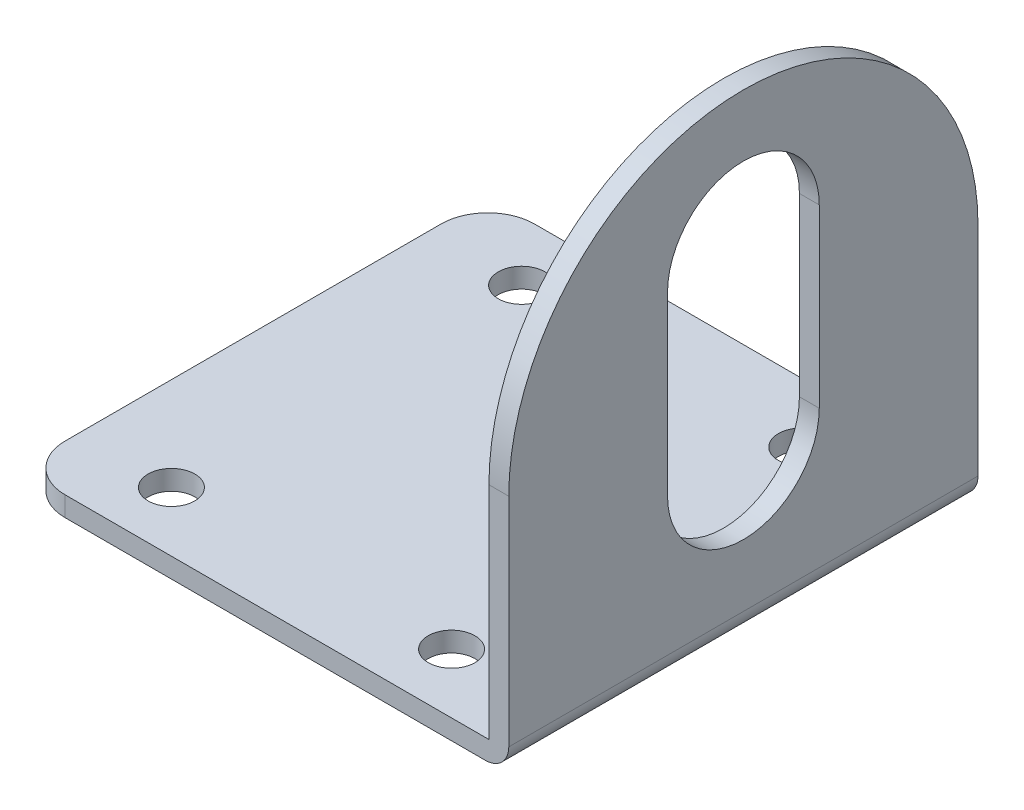
ISO-10303-21;
HEADER;
FILE_DESCRIPTION(('STEP AP214'),'2;1');
FILE_NAME('part.step','',(''),(''),'','','');
FILE_SCHEMA(('AUTOMOTIVE_DESIGN { 1 0 10303 214 1 1 1 1 }'));
ENDSEC;
DATA;
#1=APPLICATION_CONTEXT('core data for automotive mechanical design processes');
#2=APPLICATION_PROTOCOL_DEFINITION('international standard','automotive_design',2000,#1);
#3=PRODUCT_CONTEXT('',#1,'mechanical');
#4=PRODUCT('Part','Part','',(#3));
#5=PRODUCT_RELATED_PRODUCT_CATEGORY('part','',(#4));
#6=PRODUCT_DEFINITION_FORMATION('','',#4);
#7=PRODUCT_DEFINITION_CONTEXT('part definition',#1,'design');
#8=PRODUCT_DEFINITION('design','',#6,#7);
#9=PRODUCT_DEFINITION_SHAPE('','',#8);
#10=(LENGTH_UNIT() NAMED_UNIT(*) SI_UNIT(.MILLI.,.METRE.));
#11=(NAMED_UNIT(*) PLANE_ANGLE_UNIT() SI_UNIT($,.RADIAN.));
#12=(NAMED_UNIT(*) SI_UNIT($,.STERADIAN.) SOLID_ANGLE_UNIT());
#13=UNCERTAINTY_MEASURE_WITH_UNIT(LENGTH_MEASURE(1.E-05),#10,'distance_accuracy_value','');
#14=(GEOMETRIC_REPRESENTATION_CONTEXT(3) GLOBAL_UNCERTAINTY_ASSIGNED_CONTEXT((#13)) GLOBAL_UNIT_ASSIGNED_CONTEXT((#10,
#11,#12)) REPRESENTATION_CONTEXT('',''));
#15=CARTESIAN_POINT('',(0.,0.,0.));
#16=DIRECTION('',(0.,0.,1.));
#17=DIRECTION('',(1.,0.,0.));
#18=AXIS2_PLACEMENT_3D('',#15,#16,#17);
#19=CARTESIAN_POINT('',(-0.299999999999993,0.300000000000009,-40.2));
#20=DIRECTION('',(0.,0.,1.));
#21=DIRECTION('',(-1.,0.,0.));
#22=AXIS2_PLACEMENT_3D('',#19,#20,#21);
#23=CYLINDRICAL_SURFACE('',#22,2.);
#24=DIRECTION('',(0.,0.,1.));
#25=VECTOR('',#24,1.);
#26=CARTESIAN_POINT('',(1.70000000000001,0.300000000000009,-40.2));
#27=LINE('',#26,#25);
#28=CARTESIAN_POINT('',(1.70000000000001,0.300000000000002,-40.2));
#29=VERTEX_POINT('',#28);
#30=CARTESIAN_POINT('',(1.70000000000001,0.300000000000002,0.));
#31=VERTEX_POINT('',#30);
#32=EDGE_CURVE('E232',#29,#31,#27,.T.);
#33=ORIENTED_EDGE('',*,*,#32,.T.);
#34=CARTESIAN_POINT('',(-0.299999999999993,0.300000000000009,0.));
#35=DIRECTION('',(0.,0.,1.));
#36=DIRECTION('',(1.,0.,0.));
#37=AXIS2_PLACEMENT_3D('',#34,#35,#36);
#38=CIRCLE('',#37,2.);
#39=CARTESIAN_POINT('',(-0.299999999999992,-1.69999999999999,0.));
#40=VERTEX_POINT('',#39);
#41=EDGE_CURVE('E11',#31,#40,#38,.F.);
#42=ORIENTED_EDGE('',*,*,#41,.T.);
#43=DIRECTION('',(0.,0.,1.));
#44=VECTOR('',#43,1.);
#45=CARTESIAN_POINT('',(-0.299999999999993,-1.69999999999999,-40.2));
#46=LINE('',#45,#44);
#47=CARTESIAN_POINT('',(-0.299999999999992,-1.69999999999999,-40.2));
#48=VERTEX_POINT('',#47);
#49=EDGE_CURVE('E235',#40,#48,#46,.F.);
#50=ORIENTED_EDGE('',*,*,#49,.T.);
#51=CARTESIAN_POINT('',(-0.299999999999993,0.300000000000009,-40.2));
#52=DIRECTION('',(0.,0.,1.));
#53=DIRECTION('',(1.,0.,0.));
#54=AXIS2_PLACEMENT_3D('',#51,#52,#53);
#55=CIRCLE('',#54,2.);
#56=EDGE_CURVE('E42',#48,#29,#55,.T.);
#57=ORIENTED_EDGE('',*,*,#56,.T.);
#58=EDGE_LOOP('',(#33,#42,#50,#57));
#59=FACE_BOUND('',#58,.T.);
#60=ADVANCED_FACE('F35',(#59),#23,.T.);
#61=CARTESIAN_POINT('',(1.7,18.9,-20.1));
#62=DIRECTION('',(-1.,0.,0.));
#63=DIRECTION('',(0.,0.,-1.));
#64=AXIS2_PLACEMENT_3D('',#61,#62,#63);
#65=CYLINDRICAL_SURFACE('',#64,20.1);
#66=DIRECTION('',(1.,0.,0.));
#67=VECTOR('',#66,1.);
#68=CARTESIAN_POINT('',(1.7,18.9,-40.2));
#69=LINE('',#68,#67);
#70=CARTESIAN_POINT('',(1.7,18.9,-40.2));
#71=VERTEX_POINT('',#70);
#72=CARTESIAN_POINT('',(0.,18.9,-40.2));
#73=VERTEX_POINT('',#72);
#74=EDGE_CURVE('E211',#71,#73,#69,.F.);
#75=ORIENTED_EDGE('',*,*,#74,.T.);
#76=CARTESIAN_POINT('',(0.,18.9,-20.1));
#77=DIRECTION('',(-1.,0.,0.));
#78=DIRECTION('',(0.,1.,0.));
#79=AXIS2_PLACEMENT_3D('',#76,#77,#78);
#80=CIRCLE('',#79,20.1);
#81=CARTESIAN_POINT('',(0.,18.9,0.));
#82=VERTEX_POINT('',#81);
#83=EDGE_CURVE('E220',#73,#82,#80,.F.);
#84=ORIENTED_EDGE('',*,*,#83,.T.);
#85=DIRECTION('',(-1.,0.,0.));
#86=VECTOR('',#85,1.);
#87=CARTESIAN_POINT('',(0.,18.9,0.));
#88=LINE('',#87,#86);
#89=CARTESIAN_POINT('',(1.7,18.9,0.));
#90=VERTEX_POINT('',#89);
#91=EDGE_CURVE('E214',#82,#90,#88,.F.);
#92=ORIENTED_EDGE('',*,*,#91,.T.);
#93=CARTESIAN_POINT('',(1.7,18.9,-20.1));
#94=DIRECTION('',(1.,0.,0.));
#95=DIRECTION('',(0.,-1.,0.));
#96=AXIS2_PLACEMENT_3D('',#93,#94,#95);
#97=CIRCLE('',#96,20.1);
#98=EDGE_CURVE('E217',#90,#71,#97,.F.);
#99=ORIENTED_EDGE('',*,*,#98,.T.);
#100=EDGE_LOOP('',(#75,#84,#92,#99));
#101=FACE_BOUND('',#100,.T.);
#102=ADVANCED_FACE('F259',(#101),#65,.T.);
#103=CARTESIAN_POINT('',(-36.3,0.,-36.2));
#104=DIRECTION('',(0.,1.,0.));
#105=DIRECTION('',(0.,0.,-1.));
#106=AXIS2_PLACEMENT_3D('',#103,#104,#105);
#107=CYLINDRICAL_SURFACE('',#106,4.);
#108=DIRECTION('',(0.,-1.,0.));
#109=VECTOR('',#108,1.);
#110=CARTESIAN_POINT('',(-36.3,0.,-40.2));
#111=LINE('',#110,#109);
#112=CARTESIAN_POINT('',(-36.3,0.,-40.2));
#113=VERTEX_POINT('',#112);
#114=CARTESIAN_POINT('',(-36.3,-1.7,-40.2));
#115=VERTEX_POINT('',#114);
#116=EDGE_CURVE('E199',#113,#115,#111,.T.);
#117=ORIENTED_EDGE('',*,*,#116,.T.);
#118=CARTESIAN_POINT('',(-36.3,-1.7,-36.2));
#119=DIRECTION('',(0.,-1.,0.));
#120=DIRECTION('',(-1.,0.,0.));
#121=AXIS2_PLACEMENT_3D('',#118,#119,#120);
#122=CIRCLE('',#121,4.);
#123=CARTESIAN_POINT('',(-40.3,-1.7,-36.2));
#124=VERTEX_POINT('',#123);
#125=EDGE_CURVE('E208',#115,#124,#122,.F.);
#126=ORIENTED_EDGE('',*,*,#125,.T.);
#127=DIRECTION('',(0.,-1.,0.));
#128=VECTOR('',#127,1.);
#129=CARTESIAN_POINT('',(-40.3,0.,-36.2));
#130=LINE('',#129,#128);
#131=CARTESIAN_POINT('',(-40.3,0.,-36.2));
#132=VERTEX_POINT('',#131);
#133=EDGE_CURVE('E202',#124,#132,#130,.F.);
#134=ORIENTED_EDGE('',*,*,#133,.T.);
#135=CARTESIAN_POINT('',(-36.3,0.,-36.2));
#136=DIRECTION('',(0.,1.,0.));
#137=DIRECTION('',(0.,0.,1.));
#138=AXIS2_PLACEMENT_3D('',#135,#136,#137);
#139=CIRCLE('',#138,4.);
#140=EDGE_CURVE('E205',#132,#113,#139,.F.);
#141=ORIENTED_EDGE('',*,*,#140,.T.);
#142=EDGE_LOOP('',(#117,#126,#134,#141));
#143=FACE_BOUND('',#142,.T.);
#144=ADVANCED_FACE('F263',(#143),#107,.T.);
#145=CARTESIAN_POINT('',(-36.3,0.,-4.));
#146=DIRECTION('',(0.,1.,0.));
#147=DIRECTION('',(0.,0.,-1.));
#148=AXIS2_PLACEMENT_3D('',#145,#146,#147);
#149=CYLINDRICAL_SURFACE('',#148,4.);
#150=DIRECTION('',(0.,1.,0.));
#151=VECTOR('',#150,1.);
#152=CARTESIAN_POINT('',(-36.3,0.,0.));
#153=LINE('',#152,#151);
#154=CARTESIAN_POINT('',(-36.3,-1.7,0.));
#155=VERTEX_POINT('',#154);
#156=CARTESIAN_POINT('',(-36.3,0.,0.));
#157=VERTEX_POINT('',#156);
#158=EDGE_CURVE('E187',#155,#157,#153,.T.);
#159=ORIENTED_EDGE('',*,*,#158,.T.);
#160=CARTESIAN_POINT('',(-36.3,0.,-4.));
#161=DIRECTION('',(0.,1.,0.));
#162=DIRECTION('',(0.,0.,1.));
#163=AXIS2_PLACEMENT_3D('',#160,#161,#162);
#164=CIRCLE('',#163,4.);
#165=CARTESIAN_POINT('',(-40.3,0.,-4.));
#166=VERTEX_POINT('',#165);
#167=EDGE_CURVE('E196',#157,#166,#164,.F.);
#168=ORIENTED_EDGE('',*,*,#167,.T.);
#169=DIRECTION('',(0.,1.,0.));
#170=VECTOR('',#169,1.);
#171=CARTESIAN_POINT('',(-40.3,-1.7,-4.));
#172=LINE('',#171,#170);
#173=CARTESIAN_POINT('',(-40.3,-1.7,-4.));
#174=VERTEX_POINT('',#173);
#175=EDGE_CURVE('E190',#166,#174,#172,.F.);
#176=ORIENTED_EDGE('',*,*,#175,.T.);
#177=CARTESIAN_POINT('',(-36.3,-1.7,-4.));
#178=DIRECTION('',(0.,-1.,0.));
#179=DIRECTION('',(-1.,0.,0.));
#180=AXIS2_PLACEMENT_3D('',#177,#178,#179);
#181=CIRCLE('',#180,4.);
#182=EDGE_CURVE('E193',#174,#155,#181,.F.);
#183=ORIENTED_EDGE('',*,*,#182,.T.);
#184=EDGE_LOOP('',(#159,#168,#176,#183));
#185=FACE_BOUND('',#184,.T.);
#186=ADVANCED_FACE('F268',(#185),#149,.T.);
#187=CARTESIAN_POINT('',(-40.3,0.,-40.2));
#188=DIRECTION('',(0.,-1.,0.));
#189=DIRECTION('',(0.,0.,1.));
#190=AXIS2_PLACEMENT_3D('',#187,#188,#189);
#191=PLANE('',#190);
#192=CARTESIAN_POINT('',(-32.3,0.,-35.1));
#193=DIRECTION('',(0.,1.,0.));
#194=DIRECTION('',(0.,0.,1.));
#195=AXIS2_PLACEMENT_3D('',#192,#193,#194);
#196=CIRCLE('',#195,2.00000000000001);
#197=CARTESIAN_POINT('',(-32.3,0.,-33.1));
#198=VERTEX_POINT('',#197);
#199=EDGE_CURVE('E157',#198,#198,#196,.T.);
#200=ORIENTED_EDGE('',*,*,#199,.F.);
#201=EDGE_LOOP('',(#200));
#202=FACE_BOUND('',#201,.T.);
#203=CARTESIAN_POINT('',(-8.3,0.,-35.1));
#204=DIRECTION('',(0.,1.,0.));
#205=DIRECTION('',(0.,0.,1.));
#206=AXIS2_PLACEMENT_3D('',#203,#204,#205);
#207=CIRCLE('',#206,2.);
#208=CARTESIAN_POINT('',(-8.3,0.,-33.1));
#209=VERTEX_POINT('',#208);
#210=EDGE_CURVE('E341',#209,#209,#207,.T.);
#211=ORIENTED_EDGE('',*,*,#210,.F.);
#212=EDGE_LOOP('',(#211));
#213=FACE_BOUND('',#212,.T.);
#214=CARTESIAN_POINT('',(-8.3,0.,-5.1));
#215=DIRECTION('',(0.,1.,0.));
#216=DIRECTION('',(0.,0.,1.));
#217=AXIS2_PLACEMENT_3D('',#214,#215,#216);
#218=CIRCLE('',#217,2.);
#219=CARTESIAN_POINT('',(-8.3,0.,-3.1));
#220=VERTEX_POINT('',#219);
#221=EDGE_CURVE('E338',#220,#220,#218,.T.);
#222=ORIENTED_EDGE('',*,*,#221,.F.);
#223=EDGE_LOOP('',(#222));
#224=FACE_BOUND('',#223,.T.);
#225=CARTESIAN_POINT('',(-32.3,0.,-5.1));
#226=DIRECTION('',(0.,1.,0.));
#227=DIRECTION('',(0.,0.,1.));
#228=AXIS2_PLACEMENT_3D('',#225,#226,#227);
#229=CIRCLE('',#228,2.);
#230=CARTESIAN_POINT('',(-32.3,0.,-3.1));
#231=VERTEX_POINT('',#230);
#232=EDGE_CURVE('E336',#231,#231,#229,.T.);
#233=ORIENTED_EDGE('',*,*,#232,.F.);
#234=EDGE_LOOP('',(#233));
#235=FACE_BOUND('',#234,.T.);
#236=DIRECTION('',(0.,0.,1.));
#237=VECTOR('',#236,1.);
#238=CARTESIAN_POINT('',(-40.3,0.,-40.2));
#239=LINE('',#238,#237);
#240=EDGE_CURVE('E185',#132,#166,#239,.T.);
#241=ORIENTED_EDGE('',*,*,#240,.T.);
#242=ORIENTED_EDGE('',*,*,#167,.F.);
#243=DIRECTION('',(-1.,0.,0.));
#244=VECTOR('',#243,1.);
#245=CARTESIAN_POINT('',(-40.3,0.,0.));
#246=LINE('',#245,#244);
#247=CARTESIAN_POINT('',(0.,0.,0.));
#248=VERTEX_POINT('',#247);
#249=EDGE_CURVE('E164',#248,#157,#246,.T.);
#250=ORIENTED_EDGE('',*,*,#249,.F.);
#251=DIRECTION('',(0.,0.,1.));
#252=VECTOR('',#251,1.);
#253=CARTESIAN_POINT('',(0.,0.,-40.2));
#254=LINE('',#253,#252);
#255=CARTESIAN_POINT('',(0.,0.,-40.2));
#256=VERTEX_POINT('',#255);
#257=EDGE_CURVE('E175',#256,#248,#254,.T.);
#258=ORIENTED_EDGE('',*,*,#257,.F.);
#259=DIRECTION('',(-1.,0.,0.));
#260=VECTOR('',#259,1.);
#261=CARTESIAN_POINT('',(-40.3,0.,-40.2));
#262=LINE('',#261,#260);
#263=EDGE_CURVE('E167',#256,#113,#262,.T.);
#264=ORIENTED_EDGE('',*,*,#263,.T.);
#265=ORIENTED_EDGE('',*,*,#140,.F.);
#266=EDGE_LOOP('',(#241,#242,#250,#258,#264,#265));
#267=FACE_BOUND('',#266,.T.);
#268=ADVANCED_FACE('F274',(#202,#213,#224,#235,#267),#191,.F.);
#269=CARTESIAN_POINT('',(-40.3,-1.7,-40.2));
#270=DIRECTION('',(1.,0.,0.));
#271=DIRECTION('',(0.,0.,1.));
#272=AXIS2_PLACEMENT_3D('',#269,#270,#271);
#273=PLANE('',#272);
#274=DIRECTION('',(0.,0.,1.));
#275=VECTOR('',#274,1.);
#276=CARTESIAN_POINT('',(-40.3,-1.7,-40.2));
#277=LINE('',#276,#275);
#278=EDGE_CURVE('E183',#124,#174,#277,.T.);
#279=ORIENTED_EDGE('',*,*,#278,.T.);
#280=ORIENTED_EDGE('',*,*,#175,.F.);
#281=ORIENTED_EDGE('',*,*,#240,.F.);
#282=ORIENTED_EDGE('',*,*,#133,.F.);
#283=EDGE_LOOP('',(#279,#280,#281,#282));
#284=FACE_BOUND('',#283,.T.);
#285=ADVANCED_FACE('F278',(#284),#273,.F.);
#286=CARTESIAN_POINT('',(1.70000000000001,-1.69999999999999,-40.2));
#287=DIRECTION('',(0.,1.,0.));
#288=DIRECTION('',(-1.,0.,0.));
#289=AXIS2_PLACEMENT_3D('',#286,#287,#288);
#290=PLANE('',#289);
#291=CARTESIAN_POINT('',(-32.3,-1.7,-35.1));
#292=DIRECTION('',(0.,1.,0.));
#293=DIRECTION('',(-1.,0.,0.));
#294=AXIS2_PLACEMENT_3D('',#291,#292,#293);
#295=CIRCLE('',#294,2.00000000000001);
#296=CARTESIAN_POINT('',(-34.3,-1.7,-35.1));
#297=VERTEX_POINT('',#296);
#298=EDGE_CURVE('E369',#297,#297,#295,.T.);
#299=ORIENTED_EDGE('',*,*,#298,.T.);
#300=EDGE_LOOP('',(#299));
#301=FACE_BOUND('',#300,.T.);
#302=CARTESIAN_POINT('',(-8.3,-1.7,-35.1));
#303=DIRECTION('',(0.,1.,0.));
#304=DIRECTION('',(-1.,0.,0.));
#305=AXIS2_PLACEMENT_3D('',#302,#303,#304);
#306=CIRCLE('',#305,2.);
#307=CARTESIAN_POINT('',(-10.3,-1.7,-35.1));
#308=VERTEX_POINT('',#307);
#309=EDGE_CURVE('E367',#308,#308,#306,.T.);
#310=ORIENTED_EDGE('',*,*,#309,.T.);
#311=EDGE_LOOP('',(#310));
#312=FACE_BOUND('',#311,.T.);
#313=CARTESIAN_POINT('',(-8.3,-1.7,-5.1));
#314=DIRECTION('',(0.,1.,0.));
#315=DIRECTION('',(1.,0.,0.));
#316=AXIS2_PLACEMENT_3D('',#313,#314,#315);
#317=CIRCLE('',#316,2.);
#318=CARTESIAN_POINT('',(-6.29999999999999,-1.7,-5.1));
#319=VERTEX_POINT('',#318);
#320=EDGE_CURVE('E343',#319,#319,#317,.T.);
#321=ORIENTED_EDGE('',*,*,#320,.T.);
#322=EDGE_LOOP('',(#321));
#323=FACE_BOUND('',#322,.T.);
#324=CARTESIAN_POINT('',(-32.3,-1.7,-5.1));
#325=DIRECTION('',(0.,1.,0.));
#326=DIRECTION('',(1.,0.,0.));
#327=AXIS2_PLACEMENT_3D('',#324,#325,#326);
#328=CIRCLE('',#327,2.);
#329=CARTESIAN_POINT('',(-30.3,-1.7,-5.1));
#330=VERTEX_POINT('',#329);
#331=EDGE_CURVE('E333',#330,#330,#328,.T.);
#332=ORIENTED_EDGE('',*,*,#331,.T.);
#333=EDGE_LOOP('',(#332));
#334=FACE_BOUND('',#333,.T.);
#335=DIRECTION('',(1.,0.,0.));
#336=VECTOR('',#335,1.);
#337=CARTESIAN_POINT('',(1.70000000000001,-1.69999999999999,0.));
#338=LINE('',#337,#336);
#339=EDGE_CURVE('E49',#155,#40,#338,.T.);
#340=ORIENTED_EDGE('',*,*,#339,.F.);
#341=ORIENTED_EDGE('',*,*,#182,.F.);
#342=ORIENTED_EDGE('',*,*,#278,.F.);
#343=ORIENTED_EDGE('',*,*,#125,.F.);
#344=DIRECTION('',(1.,0.,0.));
#345=VECTOR('',#344,1.);
#346=CARTESIAN_POINT('',(1.70000000000001,-1.69999999999999,-40.2));
#347=LINE('',#346,#345);
#348=EDGE_CURVE('E56',#115,#48,#347,.T.);
#349=ORIENTED_EDGE('',*,*,#348,.T.);
#350=ORIENTED_EDGE('',*,*,#49,.F.);
#351=EDGE_LOOP('',(#340,#341,#342,#343,#349,#350));
#352=FACE_BOUND('',#351,.T.);
#353=ADVANCED_FACE('F282',(#301,#312,#323,#334,#352),#290,.F.);
#354=CARTESIAN_POINT('',(1.7,39.,-40.2));
#355=DIRECTION('',(-1.,0.,0.));
#356=DIRECTION('',(0.,-1.,0.));
#357=AXIS2_PLACEMENT_3D('',#354,#355,#356);
#358=PLANE('',#357);
#359=DIRECTION('',(0.,1.,0.));
#360=VECTOR('',#359,1.);
#361=CARTESIAN_POINT('',(1.70000000000001,12.1271419808871,-13.6));
#362=LINE('',#361,#360);
#363=CARTESIAN_POINT('',(1.7,12.1271419808871,-13.6));
#364=VERTEX_POINT('',#363);
#365=CARTESIAN_POINT('',(1.7,27.2132240448455,-13.6));
#366=VERTEX_POINT('',#365);
#367=EDGE_CURVE('E134',#364,#366,#362,.T.);
#368=ORIENTED_EDGE('',*,*,#367,.T.);
#369=CARTESIAN_POINT('',(1.7,27.2132240448455,-20.1));
#370=DIRECTION('',(-1.,0.,0.));
#371=DIRECTION('',(0.,1.,0.));
#372=AXIS2_PLACEMENT_3D('',#369,#370,#371);
#373=CIRCLE('',#372,6.5);
#374=CARTESIAN_POINT('',(1.7,27.2132240448455,-26.6));
#375=VERTEX_POINT('',#374);
#376=EDGE_CURVE('E144',#366,#375,#373,.T.);
#377=ORIENTED_EDGE('',*,*,#376,.T.);
#378=DIRECTION('',(0.,-1.,0.));
#379=VECTOR('',#378,1.);
#380=CARTESIAN_POINT('',(1.70000000000001,12.1271419808871,-26.6));
#381=LINE('',#380,#379);
#382=CARTESIAN_POINT('',(1.70000000000001,12.1271419808871,-26.6));
#383=VERTEX_POINT('',#382);
#384=EDGE_CURVE('E149',#375,#383,#381,.T.);
#385=ORIENTED_EDGE('',*,*,#384,.T.);
#386=CARTESIAN_POINT('',(1.70000000000001,12.1271419808871,-20.1));
#387=DIRECTION('',(-1.,0.,0.));
#388=DIRECTION('',(0.,1.,0.));
#389=AXIS2_PLACEMENT_3D('',#386,#387,#388);
#390=CIRCLE('',#389,6.5);
#391=EDGE_CURVE('E155',#383,#364,#390,.T.);
#392=ORIENTED_EDGE('',*,*,#391,.T.);
#393=EDGE_LOOP('',(#368,#377,#385,#392));
#394=FACE_BOUND('',#393,.T.);
#395=DIRECTION('',(0.,1.,0.));
#396=VECTOR('',#395,1.);
#397=CARTESIAN_POINT('',(1.7,39.,-40.2));
#398=LINE('',#397,#396);
#399=EDGE_CURVE('E171',#29,#71,#398,.T.);
#400=ORIENTED_EDGE('',*,*,#399,.T.);
#401=ORIENTED_EDGE('',*,*,#98,.F.);
#402=DIRECTION('',(0.,1.,0.));
#403=VECTOR('',#402,1.);
#404=CARTESIAN_POINT('',(1.7,39.,0.));
#405=LINE('',#404,#403);
#406=EDGE_CURVE('E178',#31,#90,#405,.T.);
#407=ORIENTED_EDGE('',*,*,#406,.F.);
#408=ORIENTED_EDGE('',*,*,#32,.F.);
#409=EDGE_LOOP('',(#400,#401,#407,#408));
#410=FACE_BOUND('',#409,.T.);
#411=ADVANCED_FACE('F152',(#394,#410),#358,.F.);
#412=CARTESIAN_POINT('',(0.,0.,-40.2));
#413=DIRECTION('',(1.,0.,0.));
#414=DIRECTION('',(0.,1.,0.));
#415=AXIS2_PLACEMENT_3D('',#412,#413,#414);
#416=PLANE('',#415);
#417=DIRECTION('',(0.,-1.,0.));
#418=VECTOR('',#417,1.);
#419=CARTESIAN_POINT('',(0.,0.,-26.6));
#420=LINE('',#419,#418);
#421=CARTESIAN_POINT('',(0.,27.2132240448455,-26.6));
#422=VERTEX_POINT('',#421);
#423=CARTESIAN_POINT('',(0.,12.1271419808871,-26.6));
#424=VERTEX_POINT('',#423);
#425=EDGE_CURVE('E226',#422,#424,#420,.T.);
#426=ORIENTED_EDGE('',*,*,#425,.F.);
#427=CARTESIAN_POINT('',(0.,27.2132240448455,-20.1));
#428=DIRECTION('',(-1.,0.,0.));
#429=DIRECTION('',(0.,1.,0.));
#430=AXIS2_PLACEMENT_3D('',#427,#428,#429);
#431=CIRCLE('',#430,6.5);
#432=CARTESIAN_POINT('',(0.,27.2132240448455,-13.6));
#433=VERTEX_POINT('',#432);
#434=EDGE_CURVE('E224',#433,#422,#431,.T.);
#435=ORIENTED_EDGE('',*,*,#434,.F.);
#436=DIRECTION('',(0.,1.,0.));
#437=VECTOR('',#436,1.);
#438=CARTESIAN_POINT('',(0.,0.,-13.6));
#439=LINE('',#438,#437);
#440=CARTESIAN_POINT('',(0.,12.1271419808871,-13.6));
#441=VERTEX_POINT('',#440);
#442=EDGE_CURVE('E136',#441,#433,#439,.T.);
#443=ORIENTED_EDGE('',*,*,#442,.F.);
#444=CARTESIAN_POINT('',(0.,12.1271419808871,-20.1));
#445=DIRECTION('',(-1.,0.,0.));
#446=DIRECTION('',(0.,1.,0.));
#447=AXIS2_PLACEMENT_3D('',#444,#445,#446);
#448=CIRCLE('',#447,6.5);
#449=EDGE_CURVE('E229',#424,#441,#448,.T.);
#450=ORIENTED_EDGE('',*,*,#449,.F.);
#451=EDGE_LOOP('',(#426,#435,#443,#450));
#452=FACE_BOUND('',#451,.T.);
#453=DIRECTION('',(0.,-1.,0.));
#454=VECTOR('',#453,1.);
#455=CARTESIAN_POINT('',(0.,0.,-40.2));
#456=LINE('',#455,#454);
#457=EDGE_CURVE('E173',#73,#256,#456,.T.);
#458=ORIENTED_EDGE('',*,*,#457,.T.);
#459=ORIENTED_EDGE('',*,*,#257,.T.);
#460=DIRECTION('',(0.,-1.,0.));
#461=VECTOR('',#460,1.);
#462=CARTESIAN_POINT('',(0.,0.,0.));
#463=LINE('',#462,#461);
#464=EDGE_CURVE('E169',#82,#248,#463,.T.);
#465=ORIENTED_EDGE('',*,*,#464,.F.);
#466=ORIENTED_EDGE('',*,*,#83,.F.);
#467=EDGE_LOOP('',(#458,#459,#465,#466));
#468=FACE_BOUND('',#467,.T.);
#469=ADVANCED_FACE('F255',(#452,#468),#416,.F.);
#470=CARTESIAN_POINT('',(0.,0.,-40.2));
#471=DIRECTION('',(0.,0.,-1.));
#472=DIRECTION('',(1.,0.,0.));
#473=AXIS2_PLACEMENT_3D('',#470,#471,#472);
#474=PLANE('',#473);
#475=ORIENTED_EDGE('',*,*,#348,.F.);
#476=ORIENTED_EDGE('',*,*,#116,.F.);
#477=ORIENTED_EDGE('',*,*,#263,.F.);
#478=ORIENTED_EDGE('',*,*,#457,.F.);
#479=ORIENTED_EDGE('',*,*,#74,.F.);
#480=ORIENTED_EDGE('',*,*,#399,.F.);
#481=ORIENTED_EDGE('',*,*,#56,.F.);
#482=EDGE_LOOP('',(#475,#476,#477,#478,#479,#480,#481));
#483=FACE_BOUND('',#482,.T.);
#484=ADVANCED_FACE('F246',(#483),#474,.T.);
#485=CARTESIAN_POINT('',(0.,0.,0.));
#486=DIRECTION('',(0.,0.,-1.));
#487=DIRECTION('',(1.,0.,0.));
#488=AXIS2_PLACEMENT_3D('',#485,#486,#487);
#489=PLANE('',#488);
#490=ORIENTED_EDGE('',*,*,#406,.T.);
#491=ORIENTED_EDGE('',*,*,#91,.F.);
#492=ORIENTED_EDGE('',*,*,#464,.T.);
#493=ORIENTED_EDGE('',*,*,#249,.T.);
#494=ORIENTED_EDGE('',*,*,#158,.F.);
#495=ORIENTED_EDGE('',*,*,#339,.T.);
#496=ORIENTED_EDGE('',*,*,#41,.F.);
#497=EDGE_LOOP('',(#490,#491,#492,#493,#494,#495,#496));
#498=FACE_BOUND('',#497,.T.);
#499=ADVANCED_FACE('F243',(#498),#489,.F.);
#500=CARTESIAN_POINT('',(-36.3,12.1271419808871,-20.1));
#501=DIRECTION('',(1.,0.,0.));
#502=DIRECTION('',(0.,1.,0.));
#503=AXIS2_PLACEMENT_3D('',#500,#501,#502);
#504=CYLINDRICAL_SURFACE('',#503,6.5);
#505=DIRECTION('',(1.,0.,0.));
#506=VECTOR('',#505,1.);
#507=CARTESIAN_POINT('',(-36.3,12.1271419808871,-26.6));
#508=LINE('',#507,#506);
#509=EDGE_CURVE('E162',#424,#383,#508,.T.);
#510=ORIENTED_EDGE('',*,*,#509,.F.);
#511=ORIENTED_EDGE('',*,*,#449,.T.);
#512=DIRECTION('',(1.,0.,0.));
#513=VECTOR('',#512,1.);
#514=CARTESIAN_POINT('',(-36.3,12.1271419808871,-13.6));
#515=LINE('',#514,#513);
#516=EDGE_CURVE('E141',#441,#364,#515,.T.);
#517=ORIENTED_EDGE('',*,*,#516,.T.);
#518=ORIENTED_EDGE('',*,*,#391,.F.);
#519=EDGE_LOOP('',(#510,#511,#517,#518));
#520=FACE_BOUND('',#519,.T.);
#521=ADVANCED_FACE('F245',(#520),#504,.F.);
#522=CARTESIAN_POINT('',(-36.3,12.1271419808871,-26.6));
#523=DIRECTION('',(0.,0.,-1.));
#524=DIRECTION('',(0.,-1.,0.));
#525=AXIS2_PLACEMENT_3D('',#522,#523,#524);
#526=PLANE('',#525);
#527=DIRECTION('',(1.,0.,0.));
#528=VECTOR('',#527,1.);
#529=CARTESIAN_POINT('',(-36.3,27.2132240448455,-26.6));
#530=LINE('',#529,#528);
#531=EDGE_CURVE('E140',#422,#375,#530,.T.);
#532=ORIENTED_EDGE('',*,*,#531,.F.);
#533=ORIENTED_EDGE('',*,*,#425,.T.);
#534=ORIENTED_EDGE('',*,*,#509,.T.);
#535=ORIENTED_EDGE('',*,*,#384,.F.);
#536=EDGE_LOOP('',(#532,#533,#534,#535));
#537=FACE_BOUND('',#536,.T.);
#538=ADVANCED_FACE('F252',(#537),#526,.F.);
#539=CARTESIAN_POINT('',(-36.3,27.2132240448455,-20.1));
#540=DIRECTION('',(1.,0.,0.));
#541=DIRECTION('',(0.,1.,0.));
#542=AXIS2_PLACEMENT_3D('',#539,#540,#541);
#543=CYLINDRICAL_SURFACE('',#542,6.5);
#544=DIRECTION('',(1.,0.,0.));
#545=VECTOR('',#544,1.);
#546=CARTESIAN_POINT('',(-36.3,27.2132240448455,-13.6));
#547=LINE('',#546,#545);
#548=EDGE_CURVE('E130',#433,#366,#547,.T.);
#549=ORIENTED_EDGE('',*,*,#548,.F.);
#550=ORIENTED_EDGE('',*,*,#434,.T.);
#551=ORIENTED_EDGE('',*,*,#531,.T.);
#552=ORIENTED_EDGE('',*,*,#376,.F.);
#553=EDGE_LOOP('',(#549,#550,#551,#552));
#554=FACE_BOUND('',#553,.T.);
#555=ADVANCED_FACE('F145',(#554),#543,.F.);
#556=CARTESIAN_POINT('',(-36.3,12.1271419808871,-13.6));
#557=DIRECTION('',(0.,0.,1.));
#558=DIRECTION('',(0.,1.,0.));
#559=AXIS2_PLACEMENT_3D('',#556,#557,#558);
#560=PLANE('',#559);
#561=ORIENTED_EDGE('',*,*,#516,.F.);
#562=ORIENTED_EDGE('',*,*,#442,.T.);
#563=ORIENTED_EDGE('',*,*,#548,.T.);
#564=ORIENTED_EDGE('',*,*,#367,.F.);
#565=EDGE_LOOP('',(#561,#562,#563,#564));
#566=FACE_BOUND('',#565,.T.);
#567=ADVANCED_FACE('F132',(#566),#560,.F.);
#568=CARTESIAN_POINT('',(-32.3,36.3,-5.1));
#569=DIRECTION('',(0.,-1.,0.));
#570=DIRECTION('',(1.,0.,0.));
#571=AXIS2_PLACEMENT_3D('',#568,#569,#570);
#572=CYLINDRICAL_SURFACE('',#571,2.);
#573=ORIENTED_EDGE('',*,*,#331,.F.);
#574=EDGE_LOOP('',(#573));
#575=FACE_BOUND('',#574,.T.);
#576=ORIENTED_EDGE('',*,*,#232,.T.);
#577=EDGE_LOOP('',(#576));
#578=FACE_BOUND('',#577,.T.);
#579=ADVANCED_FACE('F315',(#575,#578),#572,.F.);
#580=CARTESIAN_POINT('',(-8.3,36.3,-5.1));
#581=DIRECTION('',(0.,-1.,0.));
#582=DIRECTION('',(1.,0.,0.));
#583=AXIS2_PLACEMENT_3D('',#580,#581,#582);
#584=CYLINDRICAL_SURFACE('',#583,2.);
#585=ORIENTED_EDGE('',*,*,#320,.F.);
#586=EDGE_LOOP('',(#585));
#587=FACE_BOUND('',#586,.T.);
#588=ORIENTED_EDGE('',*,*,#221,.T.);
#589=EDGE_LOOP('',(#588));
#590=FACE_BOUND('',#589,.T.);
#591=ADVANCED_FACE('F322',(#587,#590),#584,.F.);
#592=CARTESIAN_POINT('',(-8.3,36.3,-35.1));
#593=DIRECTION('',(0.,-1.,0.));
#594=DIRECTION('',(1.,0.,0.));
#595=AXIS2_PLACEMENT_3D('',#592,#593,#594);
#596=CYLINDRICAL_SURFACE('',#595,2.);
#597=ORIENTED_EDGE('',*,*,#309,.F.);
#598=EDGE_LOOP('',(#597));
#599=FACE_BOUND('',#598,.T.);
#600=ORIENTED_EDGE('',*,*,#210,.T.);
#601=EDGE_LOOP('',(#600));
#602=FACE_BOUND('',#601,.T.);
#603=ADVANCED_FACE('F327',(#599,#602),#596,.F.);
#604=CARTESIAN_POINT('',(-32.3,36.3,-35.1));
#605=DIRECTION('',(0.,-1.,0.));
#606=DIRECTION('',(1.,0.,0.));
#607=AXIS2_PLACEMENT_3D('',#604,#605,#606);
#608=CYLINDRICAL_SURFACE('',#607,2.00000000000001);
#609=ORIENTED_EDGE('',*,*,#298,.F.);
#610=EDGE_LOOP('',(#609));
#611=FACE_BOUND('',#610,.T.);
#612=ORIENTED_EDGE('',*,*,#199,.T.);
#613=EDGE_LOOP('',(#612));
#614=FACE_BOUND('',#613,.T.);
#615=ADVANCED_FACE('F351',(#611,#614),#608,.F.);
#616=CLOSED_SHELL('',(#60,#102,#144,#186,#268,#285,#353,#411,#469,#484,#499,#521,#538,#555,#567,
#579,#591,#603,#615));
#617=MANIFOLD_SOLID_BREP('B2',#616);
#618=ADVANCED_BREP_SHAPE_REPRESENTATION('',(#18,#617),#14);
#619=SHAPE_DEFINITION_REPRESENTATION(#9,#618);
ENDSEC;
END-ISO-10303-21;
